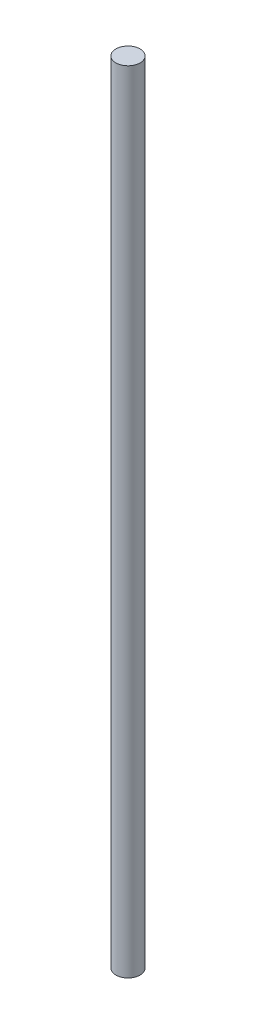
ISO-10303-21;
HEADER;
FILE_DESCRIPTION(('STEP AP214'),'2;1');
FILE_NAME('part.step','',(''),(''),'','','');
FILE_SCHEMA(('AUTOMOTIVE_DESIGN { 1 0 10303 214 1 1 1 1 }'));
ENDSEC;
DATA;
#1=APPLICATION_CONTEXT('core data for automotive mechanical design processes');
#2=APPLICATION_PROTOCOL_DEFINITION('international standard','automotive_design',2000,#1);
#3=PRODUCT_CONTEXT('',#1,'mechanical');
#4=PRODUCT('Part','Part','',(#3));
#5=PRODUCT_RELATED_PRODUCT_CATEGORY('part','',(#4));
#6=PRODUCT_DEFINITION_FORMATION('','',#4);
#7=PRODUCT_DEFINITION_CONTEXT('part definition',#1,'design');
#8=PRODUCT_DEFINITION('design','',#6,#7);
#9=PRODUCT_DEFINITION_SHAPE('','',#8);
#10=(LENGTH_UNIT() NAMED_UNIT(*) SI_UNIT(.MILLI.,.METRE.));
#11=(NAMED_UNIT(*) PLANE_ANGLE_UNIT() SI_UNIT($,.RADIAN.));
#12=(NAMED_UNIT(*) SI_UNIT($,.STERADIAN.) SOLID_ANGLE_UNIT());
#13=UNCERTAINTY_MEASURE_WITH_UNIT(LENGTH_MEASURE(1.E-05),#10,'distance_accuracy_value','');
#14=(GEOMETRIC_REPRESENTATION_CONTEXT(3) GLOBAL_UNCERTAINTY_ASSIGNED_CONTEXT((#13)) GLOBAL_UNIT_ASSIGNED_CONTEXT((#10,
#11,#12)) REPRESENTATION_CONTEXT('',''));
#15=CARTESIAN_POINT('',(0.,0.,0.));
#16=DIRECTION('',(0.,0.,1.));
#17=DIRECTION('',(1.,0.,0.));
#18=AXIS2_PLACEMENT_3D('',#15,#16,#17);
#19=CARTESIAN_POINT('',(0.,381.,0.));
#20=DIRECTION('',(0.,-1.,0.));
#21=DIRECTION('',(0.,0.,-1.));
#22=AXIS2_PLACEMENT_3D('',#19,#20,#21);
#23=CYLINDRICAL_SURFACE('',#22,5.842);
#24=CARTESIAN_POINT('',(0.,381.,0.));
#25=DIRECTION('',(0.,1.,0.));
#26=DIRECTION('',(0.,0.,1.));
#27=AXIS2_PLACEMENT_3D('',#24,#25,#26);
#28=CIRCLE('',#27,5.842);
#29=CARTESIAN_POINT('',(0.,381.,5.842));
#30=VERTEX_POINT('',#29);
#31=EDGE_CURVE('E10',#30,#30,#28,.T.);
#32=ORIENTED_EDGE('',*,*,#31,.F.);
#33=EDGE_LOOP('',(#32));
#34=FACE_BOUND('',#33,.T.);
#35=CARTESIAN_POINT('',(0.,0.,0.));
#36=DIRECTION('',(0.,1.,0.));
#37=DIRECTION('',(0.,0.,1.));
#38=AXIS2_PLACEMENT_3D('',#35,#36,#37);
#39=CIRCLE('',#38,5.842);
#40=CARTESIAN_POINT('',(0.,0.,5.842));
#41=VERTEX_POINT('',#40);
#42=EDGE_CURVE('E33',#41,#41,#39,.T.);
#43=ORIENTED_EDGE('',*,*,#42,.T.);
#44=EDGE_LOOP('',(#43));
#45=FACE_BOUND('',#44,.T.);
#46=ADVANCED_FACE('F30',(#34,#45),#23,.T.);
#47=CARTESIAN_POINT('',(0.,381.,0.));
#48=DIRECTION('',(0.,1.,0.));
#49=DIRECTION('',(0.,0.,1.));
#50=AXIS2_PLACEMENT_3D('',#47,#48,#49);
#51=PLANE('',#50);
#52=ORIENTED_EDGE('',*,*,#31,.T.);
#53=EDGE_LOOP('',(#52));
#54=FACE_BOUND('',#53,.T.);
#55=ADVANCED_FACE('F45',(#54),#51,.T.);
#56=CARTESIAN_POINT('',(0.,0.,0.));
#57=DIRECTION('',(0.,1.,0.));
#58=DIRECTION('',(0.,0.,1.));
#59=AXIS2_PLACEMENT_3D('',#56,#57,#58);
#60=PLANE('',#59);
#61=ORIENTED_EDGE('',*,*,#42,.F.);
#62=EDGE_LOOP('',(#61));
#63=FACE_BOUND('',#62,.T.);
#64=ADVANCED_FACE('F43',(#63),#60,.F.);
#65=CLOSED_SHELL('',(#46,#55,#64));
#66=MANIFOLD_SOLID_BREP('B2',#65);
#67=ADVANCED_BREP_SHAPE_REPRESENTATION('',(#18,#66),#14);
#68=SHAPE_DEFINITION_REPRESENTATION(#9,#67);
ENDSEC;
END-ISO-10303-21;
